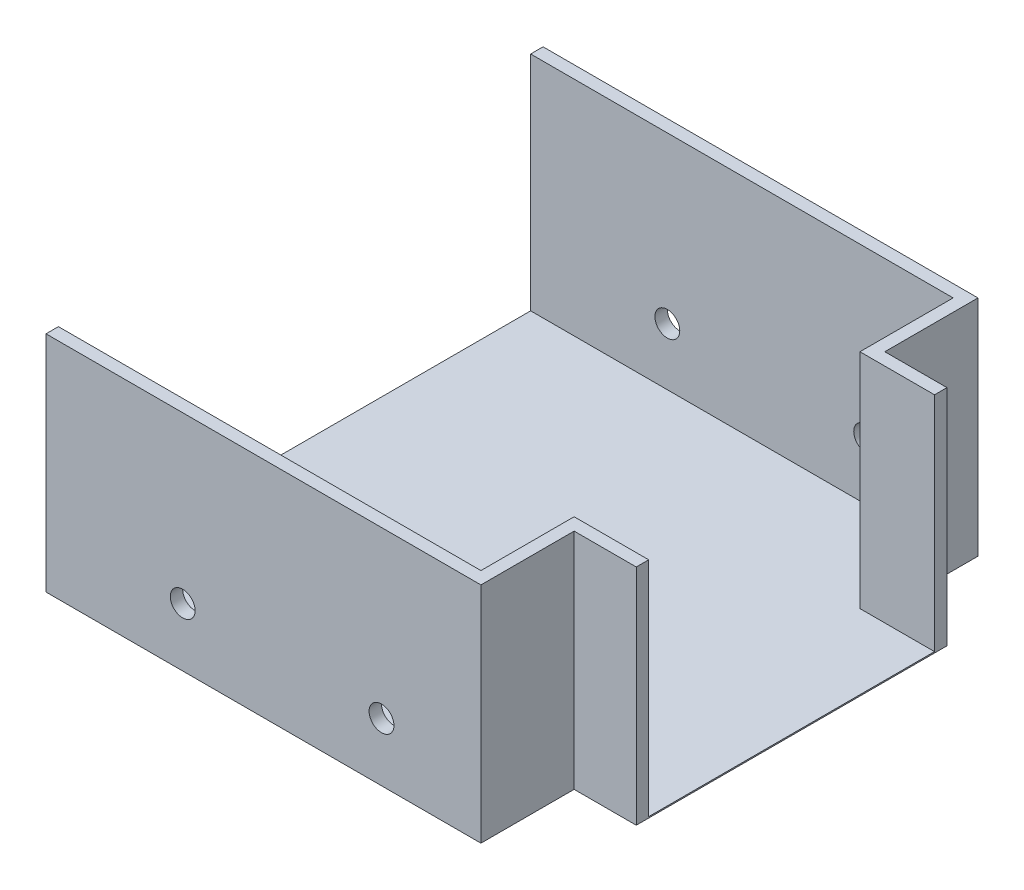
ISO-10303-21;
HEADER;
FILE_DESCRIPTION(('STEP AP214'),'2;1');
FILE_NAME('part.step','',(''),(''),'','','');
FILE_SCHEMA(('AUTOMOTIVE_DESIGN { 1 0 10303 214 1 1 1 1 }'));
ENDSEC;
DATA;
#1=APPLICATION_CONTEXT('core data for automotive mechanical design processes');
#2=APPLICATION_PROTOCOL_DEFINITION('international standard','automotive_design',2000,#1);
#3=PRODUCT_CONTEXT('',#1,'mechanical');
#4=PRODUCT('Part','Part','',(#3));
#5=PRODUCT_RELATED_PRODUCT_CATEGORY('part','',(#4));
#6=PRODUCT_DEFINITION_FORMATION('','',#4);
#7=PRODUCT_DEFINITION_CONTEXT('part definition',#1,'design');
#8=PRODUCT_DEFINITION('design','',#6,#7);
#9=PRODUCT_DEFINITION_SHAPE('','',#8);
#10=(LENGTH_UNIT() NAMED_UNIT(*) SI_UNIT(.MILLI.,.METRE.));
#11=(NAMED_UNIT(*) PLANE_ANGLE_UNIT() SI_UNIT($,.RADIAN.));
#12=(NAMED_UNIT(*) SI_UNIT($,.STERADIAN.) SOLID_ANGLE_UNIT());
#13=UNCERTAINTY_MEASURE_WITH_UNIT(LENGTH_MEASURE(1.E-05),#10,'distance_accuracy_value','');
#14=(GEOMETRIC_REPRESENTATION_CONTEXT(3) GLOBAL_UNCERTAINTY_ASSIGNED_CONTEXT((#13)) GLOBAL_UNIT_ASSIGNED_CONTEXT((#10,
#11,#12)) REPRESENTATION_CONTEXT('',''));
#15=CARTESIAN_POINT('',(0.,0.,0.));
#16=DIRECTION('',(0.,0.,1.));
#17=DIRECTION('',(1.,0.,0.));
#18=AXIS2_PLACEMENT_3D('',#15,#16,#17);
#19=CARTESIAN_POINT('',(0.,180.,0.));
#20=DIRECTION('',(0.,1.,0.));
#21=DIRECTION('',(0.,0.,1.));
#22=AXIS2_PLACEMENT_3D('',#19,#20,#21);
#23=PLANE('',#22);
#24=DIRECTION('',(1.,0.,0.));
#25=VECTOR('',#24,1.);
#26=CARTESIAN_POINT('',(0.,180.,190.));
#27=LINE('',#26,#25);
#28=CARTESIAN_POINT('',(-175.,180.,190.));
#29=VERTEX_POINT('',#28);
#30=CARTESIAN_POINT('',(165.,180.,190.));
#31=VERTEX_POINT('',#30);
#32=EDGE_CURVE('E260',#29,#31,#27,.T.);
#33=ORIENTED_EDGE('',*,*,#32,.F.);
#34=DIRECTION('',(0.,0.,1.));
#35=VECTOR('',#34,1.);
#36=CARTESIAN_POINT('',(-175.,180.,0.));
#37=LINE('',#36,#35);
#38=CARTESIAN_POINT('',(-175.,180.,200.));
#39=VERTEX_POINT('',#38);
#40=EDGE_CURVE('E294',#29,#39,#37,.T.);
#41=ORIENTED_EDGE('',*,*,#40,.T.);
#42=DIRECTION('',(1.,0.,0.));
#43=VECTOR('',#42,1.);
#44=CARTESIAN_POINT('',(0.,180.,200.));
#45=LINE('',#44,#43);
#46=CARTESIAN_POINT('',(175.,180.,200.));
#47=VERTEX_POINT('',#46);
#48=EDGE_CURVE('E299',#39,#47,#45,.T.);
#49=ORIENTED_EDGE('',*,*,#48,.T.);
#50=DIRECTION('',(0.,0.,1.));
#51=VECTOR('',#50,1.);
#52=CARTESIAN_POINT('',(175.,180.,0.));
#53=LINE('',#52,#51);
#54=CARTESIAN_POINT('',(175.,180.,125.));
#55=VERTEX_POINT('',#54);
#56=EDGE_CURVE('E145',#55,#47,#53,.T.);
#57=ORIENTED_EDGE('',*,*,#56,.F.);
#58=DIRECTION('',(1.,0.,0.));
#59=VECTOR('',#58,1.);
#60=CARTESIAN_POINT('',(0.,180.,125.));
#61=LINE('',#60,#59);
#62=CARTESIAN_POINT('',(225.,180.,125.));
#63=VERTEX_POINT('',#62);
#64=EDGE_CURVE('E139',#55,#63,#61,.T.);
#65=ORIENTED_EDGE('',*,*,#64,.T.);
#66=DIRECTION('',(0.,0.,1.));
#67=VECTOR('',#66,1.);
#68=CARTESIAN_POINT('',(225.,180.,0.));
#69=LINE('',#68,#67);
#70=CARTESIAN_POINT('',(225.,180.,115.));
#71=VERTEX_POINT('',#70);
#72=EDGE_CURVE('E124',#71,#63,#69,.T.);
#73=ORIENTED_EDGE('',*,*,#72,.F.);
#74=DIRECTION('',(1.,0.,0.));
#75=VECTOR('',#74,1.);
#76=CARTESIAN_POINT('',(0.,180.,115.));
#77=LINE('',#76,#75);
#78=CARTESIAN_POINT('',(165.,180.,115.));
#79=VERTEX_POINT('',#78);
#80=EDGE_CURVE('E229',#79,#71,#77,.T.);
#81=ORIENTED_EDGE('',*,*,#80,.F.);
#82=DIRECTION('',(0.,0.,-1.));
#83=VECTOR('',#82,1.);
#84=CARTESIAN_POINT('',(165.,180.,0.));
#85=LINE('',#84,#83);
#86=EDGE_CURVE('E264',#31,#79,#85,.T.);
#87=ORIENTED_EDGE('',*,*,#86,.F.);
#88=EDGE_LOOP('',(#33,#41,#49,#57,#65,#73,#81,#87));
#89=FACE_BOUND('',#88,.T.);
#90=ADVANCED_FACE('F43',(#89),#23,.T.);
#91=CARTESIAN_POINT('',(175.,180.,0.));
#92=DIRECTION('',(1.,0.,0.));
#93=DIRECTION('',(0.,0.,-1.));
#94=AXIS2_PLACEMENT_3D('',#91,#92,#93);
#95=PLANE('',#94);
#96=DIRECTION('',(0.,0.,1.));
#97=VECTOR('',#96,1.);
#98=CARTESIAN_POINT('',(175.,0.,0.));
#99=LINE('',#98,#97);
#100=CARTESIAN_POINT('',(175.,0.,-200.));
#101=VERTEX_POINT('',#100);
#102=CARTESIAN_POINT('',(175.,0.,-125.));
#103=VERTEX_POINT('',#102);
#104=EDGE_CURVE('E275',#101,#103,#99,.T.);
#105=ORIENTED_EDGE('',*,*,#104,.F.);
#106=DIRECTION('',(0.,-1.,0.));
#107=VECTOR('',#106,1.);
#108=CARTESIAN_POINT('',(175.,180.,-200.));
#109=LINE('',#108,#107);
#110=CARTESIAN_POINT('',(175.,180.,-200.));
#111=VERTEX_POINT('',#110);
#112=EDGE_CURVE('E11',#111,#101,#109,.T.);
#113=ORIENTED_EDGE('',*,*,#112,.F.);
#114=CARTESIAN_POINT('',(175.,180.,-125.));
#115=VERTEX_POINT('',#114);
#116=EDGE_CURVE('E286',#111,#115,#53,.T.);
#117=ORIENTED_EDGE('',*,*,#116,.T.);
#118=DIRECTION('',(0.,-1.,0.));
#119=VECTOR('',#118,1.);
#120=CARTESIAN_POINT('',(175.,180.,-125.));
#121=LINE('',#120,#119);
#122=EDGE_CURVE('E70',#115,#103,#121,.T.);
#123=ORIENTED_EDGE('',*,*,#122,.T.);
#124=EDGE_LOOP('',(#105,#113,#117,#123));
#125=FACE_BOUND('',#124,.T.);
#126=ADVANCED_FACE('F357',(#125),#95,.T.);
#127=CARTESIAN_POINT('',(0.,180.,-200.));
#128=DIRECTION('',(0.,0.,-1.));
#129=DIRECTION('',(-1.,0.,0.));
#130=AXIS2_PLACEMENT_3D('',#127,#128,#129);
#131=PLANE('',#130);
#132=CARTESIAN_POINT('',(95.,47.,-200.));
#133=DIRECTION('',(0.,0.,1.));
#134=DIRECTION('',(1.,0.,0.));
#135=AXIS2_PLACEMENT_3D('',#132,#133,#134);
#136=CIRCLE('',#135,9.99999999999999);
#137=CARTESIAN_POINT('',(105.,47.,-200.));
#138=VERTEX_POINT('',#137);
#139=EDGE_CURVE('E175',#138,#138,#136,.T.);
#140=ORIENTED_EDGE('',*,*,#139,.T.);
#141=EDGE_LOOP('',(#140));
#142=FACE_BOUND('',#141,.T.);
#143=CARTESIAN_POINT('',(-65.,47.,-200.));
#144=DIRECTION('',(0.,0.,1.));
#145=DIRECTION('',(1.,0.,0.));
#146=AXIS2_PLACEMENT_3D('',#143,#144,#145);
#147=CIRCLE('',#146,10.);
#148=CARTESIAN_POINT('',(-55.,47.,-200.));
#149=VERTEX_POINT('',#148);
#150=EDGE_CURVE('E189',#149,#149,#147,.T.);
#151=ORIENTED_EDGE('',*,*,#150,.T.);
#152=EDGE_LOOP('',(#151));
#153=FACE_BOUND('',#152,.T.);
#154=DIRECTION('',(1.,0.,0.));
#155=VECTOR('',#154,1.);
#156=CARTESIAN_POINT('',(0.,0.,-200.));
#157=LINE('',#156,#155);
#158=CARTESIAN_POINT('',(-175.,0.,-200.));
#159=VERTEX_POINT('',#158);
#160=EDGE_CURVE('E309',#159,#101,#157,.T.);
#161=ORIENTED_EDGE('',*,*,#160,.F.);
#162=DIRECTION('',(0.,-1.,0.));
#163=VECTOR('',#162,1.);
#164=CARTESIAN_POINT('',(-175.,180.,-200.));
#165=LINE('',#164,#163);
#166=CARTESIAN_POINT('',(-175.,180.,-200.));
#167=VERTEX_POINT('',#166);
#168=EDGE_CURVE('E53',#167,#159,#165,.T.);
#169=ORIENTED_EDGE('',*,*,#168,.F.);
#170=DIRECTION('',(1.,0.,0.));
#171=VECTOR('',#170,1.);
#172=CARTESIAN_POINT('',(0.,180.,-200.));
#173=LINE('',#172,#171);
#174=EDGE_CURVE('E289',#167,#111,#173,.T.);
#175=ORIENTED_EDGE('',*,*,#174,.T.);
#176=ORIENTED_EDGE('',*,*,#112,.T.);
#177=EDGE_LOOP('',(#161,#169,#175,#176));
#178=FACE_BOUND('',#177,.T.);
#179=ADVANCED_FACE('F45',(#142,#153,#178),#131,.T.);
#180=CARTESIAN_POINT('',(-175.,180.,0.));
#181=DIRECTION('',(1.,0.,0.));
#182=DIRECTION('',(0.,0.,-1.));
#183=AXIS2_PLACEMENT_3D('',#180,#181,#182);
#184=PLANE('',#183);
#185=ORIENTED_EDGE('',*,*,#40,.F.);
#186=DIRECTION('',(0.,1.,0.));
#187=VECTOR('',#186,1.);
#188=CARTESIAN_POINT('',(-175.,1.,190.));
#189=LINE('',#188,#187);
#190=CARTESIAN_POINT('',(-175.,1.,190.));
#191=VERTEX_POINT('',#190);
#192=EDGE_CURVE('E207',#191,#29,#189,.T.);
#193=ORIENTED_EDGE('',*,*,#192,.F.);
#194=DIRECTION('',(0.,0.,1.));
#195=VECTOR('',#194,1.);
#196=CARTESIAN_POINT('',(-175.,1.,190.));
#197=LINE('',#196,#195);
#198=CARTESIAN_POINT('',(-175.,1.,-190.));
#199=VERTEX_POINT('',#198);
#200=EDGE_CURVE('E211',#199,#191,#197,.T.);
#201=ORIENTED_EDGE('',*,*,#200,.F.);
#202=DIRECTION('',(0.,-1.,0.));
#203=VECTOR('',#202,1.);
#204=CARTESIAN_POINT('',(-175.,1.,-190.));
#205=LINE('',#204,#203);
#206=CARTESIAN_POINT('',(-175.,180.,-190.));
#207=VERTEX_POINT('',#206);
#208=EDGE_CURVE('E203',#207,#199,#205,.T.);
#209=ORIENTED_EDGE('',*,*,#208,.F.);
#210=EDGE_CURVE('E295',#167,#207,#37,.T.);
#211=ORIENTED_EDGE('',*,*,#210,.F.);
#212=ORIENTED_EDGE('',*,*,#168,.T.);
#213=DIRECTION('',(0.,0.,1.));
#214=VECTOR('',#213,1.);
#215=CARTESIAN_POINT('',(-175.,0.,0.));
#216=LINE('',#215,#214);
#217=CARTESIAN_POINT('',(-175.,0.,200.));
#218=VERTEX_POINT('',#217);
#219=EDGE_CURVE('E314',#159,#218,#216,.T.);
#220=ORIENTED_EDGE('',*,*,#219,.T.);
#221=DIRECTION('',(0.,-1.,0.));
#222=VECTOR('',#221,1.);
#223=CARTESIAN_POINT('',(-175.,180.,200.));
#224=LINE('',#223,#222);
#225=EDGE_CURVE('E166',#39,#218,#224,.T.);
#226=ORIENTED_EDGE('',*,*,#225,.F.);
#227=EDGE_LOOP('',(#185,#193,#201,#209,#211,#212,#220,#226));
#228=FACE_BOUND('',#227,.T.);
#229=ADVANCED_FACE('F390',(#228),#184,.F.);
#230=CARTESIAN_POINT('',(0.,180.,200.));
#231=DIRECTION('',(0.,0.,-1.));
#232=DIRECTION('',(-1.,0.,0.));
#233=AXIS2_PLACEMENT_3D('',#230,#231,#232);
#234=PLANE('',#233);
#235=CARTESIAN_POINT('',(95.,47.,200.));
#236=DIRECTION('',(0.,0.,1.));
#237=DIRECTION('',(1.,0.,0.));
#238=AXIS2_PLACEMENT_3D('',#235,#236,#237);
#239=CIRCLE('',#238,9.99999999999999);
#240=CARTESIAN_POINT('',(105.,47.,200.));
#241=VERTEX_POINT('',#240);
#242=EDGE_CURVE('E183',#241,#241,#239,.T.);
#243=ORIENTED_EDGE('',*,*,#242,.F.);
#244=EDGE_LOOP('',(#243));
#245=FACE_BOUND('',#244,.T.);
#246=CARTESIAN_POINT('',(-65.,47.,200.));
#247=DIRECTION('',(0.,0.,1.));
#248=DIRECTION('',(1.,0.,0.));
#249=AXIS2_PLACEMENT_3D('',#246,#247,#248);
#250=CIRCLE('',#249,10.);
#251=CARTESIAN_POINT('',(-55.,47.,200.));
#252=VERTEX_POINT('',#251);
#253=EDGE_CURVE('E195',#252,#252,#250,.T.);
#254=ORIENTED_EDGE('',*,*,#253,.F.);
#255=EDGE_LOOP('',(#254));
#256=FACE_BOUND('',#255,.T.);
#257=DIRECTION('',(1.,0.,0.));
#258=VECTOR('',#257,1.);
#259=CARTESIAN_POINT('',(0.,0.,200.));
#260=LINE('',#259,#258);
#261=CARTESIAN_POINT('',(175.,0.,200.));
#262=VERTEX_POINT('',#261);
#263=EDGE_CURVE('E317',#218,#262,#260,.T.);
#264=ORIENTED_EDGE('',*,*,#263,.T.);
#265=DIRECTION('',(0.,-1.,0.));
#266=VECTOR('',#265,1.);
#267=CARTESIAN_POINT('',(175.,180.,200.));
#268=LINE('',#267,#266);
#269=EDGE_CURVE('E159',#47,#262,#268,.T.);
#270=ORIENTED_EDGE('',*,*,#269,.F.);
#271=ORIENTED_EDGE('',*,*,#48,.F.);
#272=ORIENTED_EDGE('',*,*,#225,.T.);
#273=EDGE_LOOP('',(#264,#270,#271,#272));
#274=FACE_BOUND('',#273,.T.);
#275=ADVANCED_FACE('F436',(#245,#256,#274),#234,.F.);
#276=CARTESIAN_POINT('',(175.,0.,125.));
#277=VERTEX_POINT('',#276);
#278=EDGE_CURVE('E310',#277,#262,#99,.T.);
#279=ORIENTED_EDGE('',*,*,#278,.F.);
#280=DIRECTION('',(0.,-1.,0.));
#281=VECTOR('',#280,1.);
#282=CARTESIAN_POINT('',(175.,180.,125.));
#283=LINE('',#282,#281);
#284=EDGE_CURVE('E154',#55,#277,#283,.T.);
#285=ORIENTED_EDGE('',*,*,#284,.F.);
#286=ORIENTED_EDGE('',*,*,#56,.T.);
#287=ORIENTED_EDGE('',*,*,#269,.T.);
#288=EDGE_LOOP('',(#279,#285,#286,#287));
#289=FACE_BOUND('',#288,.T.);
#290=ADVANCED_FACE('F364',(#289),#95,.T.);
#291=CARTESIAN_POINT('',(0.,180.,125.));
#292=DIRECTION('',(0.,0.,-1.));
#293=DIRECTION('',(-1.,0.,0.));
#294=AXIS2_PLACEMENT_3D('',#291,#292,#293);
#295=PLANE('',#294);
#296=DIRECTION('',(1.,0.,0.));
#297=VECTOR('',#296,1.);
#298=CARTESIAN_POINT('',(0.,0.,125.));
#299=LINE('',#298,#297);
#300=CARTESIAN_POINT('',(225.,0.,125.));
#301=VERTEX_POINT('',#300);
#302=EDGE_CURVE('E151',#277,#301,#299,.T.);
#303=ORIENTED_EDGE('',*,*,#302,.T.);
#304=DIRECTION('',(0.,-1.,0.));
#305=VECTOR('',#304,1.);
#306=CARTESIAN_POINT('',(225.,180.,125.));
#307=LINE('',#306,#305);
#308=EDGE_CURVE('E129',#63,#301,#307,.T.);
#309=ORIENTED_EDGE('',*,*,#308,.F.);
#310=ORIENTED_EDGE('',*,*,#64,.F.);
#311=ORIENTED_EDGE('',*,*,#284,.T.);
#312=EDGE_LOOP('',(#303,#309,#310,#311));
#313=FACE_BOUND('',#312,.T.);
#314=ADVANCED_FACE('F149',(#313),#295,.F.);
#315=CARTESIAN_POINT('',(225.,180.,0.));
#316=DIRECTION('',(1.,0.,0.));
#317=DIRECTION('',(0.,0.,-1.));
#318=AXIS2_PLACEMENT_3D('',#315,#316,#317);
#319=PLANE('',#318);
#320=DIRECTION('',(0.,1.,0.));
#321=VECTOR('',#320,1.);
#322=CARTESIAN_POINT('',(225.,1.,115.));
#323=LINE('',#322,#321);
#324=CARTESIAN_POINT('',(225.,1.,115.));
#325=VERTEX_POINT('',#324);
#326=EDGE_CURVE('E134',#325,#71,#323,.T.);
#327=ORIENTED_EDGE('',*,*,#326,.T.);
#328=ORIENTED_EDGE('',*,*,#72,.T.);
#329=ORIENTED_EDGE('',*,*,#308,.T.);
#330=DIRECTION('',(0.,0.,1.));
#331=VECTOR('',#330,1.);
#332=CARTESIAN_POINT('',(225.,0.,0.));
#333=LINE('',#332,#331);
#334=CARTESIAN_POINT('',(225.,0.,-125.));
#335=VERTEX_POINT('',#334);
#336=EDGE_CURVE('E323',#335,#301,#333,.T.);
#337=ORIENTED_EDGE('',*,*,#336,.F.);
#338=DIRECTION('',(0.,-1.,0.));
#339=VECTOR('',#338,1.);
#340=CARTESIAN_POINT('',(225.,180.,-125.));
#341=LINE('',#340,#339);
#342=CARTESIAN_POINT('',(225.,180.,-125.));
#343=VERTEX_POINT('',#342);
#344=EDGE_CURVE('E155',#343,#335,#341,.T.);
#345=ORIENTED_EDGE('',*,*,#344,.F.);
#346=CARTESIAN_POINT('',(225.,180.,-115.));
#347=VERTEX_POINT('',#346);
#348=EDGE_CURVE('E138',#343,#347,#69,.T.);
#349=ORIENTED_EDGE('',*,*,#348,.T.);
#350=DIRECTION('',(0.,-1.,0.));
#351=VECTOR('',#350,1.);
#352=CARTESIAN_POINT('',(225.,1.,-115.));
#353=LINE('',#352,#351);
#354=CARTESIAN_POINT('',(225.,1.,-115.));
#355=VERTEX_POINT('',#354);
#356=EDGE_CURVE('E218',#347,#355,#353,.T.);
#357=ORIENTED_EDGE('',*,*,#356,.T.);
#358=DIRECTION('',(0.,0.,1.));
#359=VECTOR('',#358,1.);
#360=CARTESIAN_POINT('',(225.,1.,-115.));
#361=LINE('',#360,#359);
#362=EDGE_CURVE('E215',#355,#325,#361,.T.);
#363=ORIENTED_EDGE('',*,*,#362,.T.);
#364=EDGE_LOOP('',(#327,#328,#329,#337,#345,#349,#357,#363));
#365=FACE_BOUND('',#364,.T.);
#366=ADVANCED_FACE('F126',(#365),#319,.T.);
#367=CARTESIAN_POINT('',(0.,180.,-125.));
#368=DIRECTION('',(0.,0.,-1.));
#369=DIRECTION('',(-1.,0.,0.));
#370=AXIS2_PLACEMENT_3D('',#367,#368,#369);
#371=PLANE('',#370);
#372=DIRECTION('',(1.,0.,0.));
#373=VECTOR('',#372,1.);
#374=CARTESIAN_POINT('',(0.,0.,-125.));
#375=LINE('',#374,#373);
#376=EDGE_CURVE('E290',#103,#335,#375,.T.);
#377=ORIENTED_EDGE('',*,*,#376,.F.);
#378=ORIENTED_EDGE('',*,*,#122,.F.);
#379=DIRECTION('',(1.,0.,0.));
#380=VECTOR('',#379,1.);
#381=CARTESIAN_POINT('',(0.,180.,-125.));
#382=LINE('',#381,#380);
#383=EDGE_CURVE('E304',#115,#343,#382,.T.);
#384=ORIENTED_EDGE('',*,*,#383,.T.);
#385=ORIENTED_EDGE('',*,*,#344,.T.);
#386=EDGE_LOOP('',(#377,#378,#384,#385));
#387=FACE_BOUND('',#386,.T.);
#388=ADVANCED_FACE('F369',(#387),#371,.T.);
#389=ORIENTED_EDGE('',*,*,#210,.T.);
#390=DIRECTION('',(-1.,0.,0.));
#391=VECTOR('',#390,1.);
#392=CARTESIAN_POINT('',(0.,180.,-190.));
#393=LINE('',#392,#391);
#394=CARTESIAN_POINT('',(165.,180.,-190.));
#395=VERTEX_POINT('',#394);
#396=EDGE_CURVE('E256',#395,#207,#393,.T.);
#397=ORIENTED_EDGE('',*,*,#396,.F.);
#398=DIRECTION('',(0.,0.,-1.));
#399=VECTOR('',#398,1.);
#400=CARTESIAN_POINT('',(165.,180.,-1.22124532708767E-13));
#401=LINE('',#400,#399);
#402=CARTESIAN_POINT('',(165.,180.,-115.));
#403=VERTEX_POINT('',#402);
#404=EDGE_CURVE('E252',#403,#395,#401,.T.);
#405=ORIENTED_EDGE('',*,*,#404,.F.);
#406=DIRECTION('',(-1.,0.,0.));
#407=VECTOR('',#406,1.);
#408=CARTESIAN_POINT('',(0.,180.,-115.));
#409=LINE('',#408,#407);
#410=EDGE_CURVE('E61',#347,#403,#409,.T.);
#411=ORIENTED_EDGE('',*,*,#410,.F.);
#412=ORIENTED_EDGE('',*,*,#348,.F.);
#413=ORIENTED_EDGE('',*,*,#383,.F.);
#414=ORIENTED_EDGE('',*,*,#116,.F.);
#415=ORIENTED_EDGE('',*,*,#174,.F.);
#416=EDGE_LOOP('',(#389,#397,#405,#411,#412,#413,#414,#415));
#417=FACE_BOUND('',#416,.T.);
#418=ADVANCED_FACE('F359',(#417),#23,.T.);
#419=CARTESIAN_POINT('',(0.,0.,0.));
#420=DIRECTION('',(0.,1.,0.));
#421=DIRECTION('',(0.,0.,1.));
#422=AXIS2_PLACEMENT_3D('',#419,#420,#421);
#423=PLANE('',#422);
#424=ORIENTED_EDGE('',*,*,#104,.T.);
#425=ORIENTED_EDGE('',*,*,#376,.T.);
#426=ORIENTED_EDGE('',*,*,#336,.T.);
#427=ORIENTED_EDGE('',*,*,#302,.F.);
#428=ORIENTED_EDGE('',*,*,#278,.T.);
#429=ORIENTED_EDGE('',*,*,#263,.F.);
#430=ORIENTED_EDGE('',*,*,#219,.F.);
#431=ORIENTED_EDGE('',*,*,#160,.T.);
#432=EDGE_LOOP('',(#424,#425,#426,#427,#428,#429,#430,#431));
#433=FACE_BOUND('',#432,.T.);
#434=ADVANCED_FACE('F368',(#433),#423,.F.);
#435=CARTESIAN_POINT('',(0.,1.,-115.));
#436=DIRECTION('',(0.,0.,-1.));
#437=DIRECTION('',(-1.,0.,0.));
#438=AXIS2_PLACEMENT_3D('',#435,#436,#437);
#439=PLANE('',#438);
#440=ORIENTED_EDGE('',*,*,#410,.T.);
#441=DIRECTION('',(0.,1.,0.));
#442=VECTOR('',#441,1.);
#443=CARTESIAN_POINT('',(165.,1.,-115.));
#444=LINE('',#443,#442);
#445=CARTESIAN_POINT('',(165.,1.,-115.));
#446=VERTEX_POINT('',#445);
#447=EDGE_CURVE('E249',#446,#403,#444,.T.);
#448=ORIENTED_EDGE('',*,*,#447,.F.);
#449=DIRECTION('',(-1.,0.,0.));
#450=VECTOR('',#449,1.);
#451=CARTESIAN_POINT('',(0.,1.,-115.));
#452=LINE('',#451,#450);
#453=EDGE_CURVE('E224',#355,#446,#452,.T.);
#454=ORIENTED_EDGE('',*,*,#453,.F.);
#455=ORIENTED_EDGE('',*,*,#356,.F.);
#456=EDGE_LOOP('',(#440,#448,#454,#455));
#457=FACE_BOUND('',#456,.T.);
#458=ADVANCED_FACE('F375',(#457),#439,.F.);
#459=CARTESIAN_POINT('',(0.,1.,115.));
#460=DIRECTION('',(0.,0.,1.));
#461=DIRECTION('',(1.,0.,0.));
#462=AXIS2_PLACEMENT_3D('',#459,#460,#461);
#463=PLANE('',#462);
#464=ORIENTED_EDGE('',*,*,#80,.T.);
#465=ORIENTED_EDGE('',*,*,#326,.F.);
#466=DIRECTION('',(1.,0.,0.));
#467=VECTOR('',#466,1.);
#468=CARTESIAN_POINT('',(0.,1.,115.));
#469=LINE('',#468,#467);
#470=CARTESIAN_POINT('',(165.,1.,115.));
#471=VERTEX_POINT('',#470);
#472=EDGE_CURVE('E245',#471,#325,#469,.T.);
#473=ORIENTED_EDGE('',*,*,#472,.F.);
#474=DIRECTION('',(0.,1.,0.));
#475=VECTOR('',#474,1.);
#476=CARTESIAN_POINT('',(165.,1.,115.));
#477=LINE('',#476,#475);
#478=EDGE_CURVE('E271',#471,#79,#477,.T.);
#479=ORIENTED_EDGE('',*,*,#478,.T.);
#480=EDGE_LOOP('',(#464,#465,#473,#479));
#481=FACE_BOUND('',#480,.T.);
#482=ADVANCED_FACE('F426',(#481),#463,.F.);
#483=CARTESIAN_POINT('',(165.,1.,0.));
#484=DIRECTION('',(1.,0.,0.));
#485=DIRECTION('',(0.,0.,-1.));
#486=AXIS2_PLACEMENT_3D('',#483,#484,#485);
#487=PLANE('',#486);
#488=ORIENTED_EDGE('',*,*,#86,.T.);
#489=ORIENTED_EDGE('',*,*,#478,.F.);
#490=DIRECTION('',(0.,0.,-1.));
#491=VECTOR('',#490,1.);
#492=CARTESIAN_POINT('',(165.,1.,0.));
#493=LINE('',#492,#491);
#494=CARTESIAN_POINT('',(165.,1.,190.));
#495=VERTEX_POINT('',#494);
#496=EDGE_CURVE('E241',#495,#471,#493,.T.);
#497=ORIENTED_EDGE('',*,*,#496,.F.);
#498=DIRECTION('',(0.,1.,0.));
#499=VECTOR('',#498,1.);
#500=CARTESIAN_POINT('',(165.,1.,190.));
#501=LINE('',#500,#499);
#502=EDGE_CURVE('E276',#495,#31,#501,.T.);
#503=ORIENTED_EDGE('',*,*,#502,.T.);
#504=EDGE_LOOP('',(#488,#489,#497,#503));
#505=FACE_BOUND('',#504,.T.);
#506=ADVANCED_FACE('F428',(#505),#487,.F.);
#507=CARTESIAN_POINT('',(0.,1.,190.));
#508=DIRECTION('',(0.,0.,1.));
#509=DIRECTION('',(1.,0.,0.));
#510=AXIS2_PLACEMENT_3D('',#507,#508,#509);
#511=PLANE('',#510);
#512=CARTESIAN_POINT('',(95.,47.,190.));
#513=DIRECTION('',(0.,0.,1.));
#514=DIRECTION('',(1.,0.,0.));
#515=AXIS2_PLACEMENT_3D('',#512,#513,#514);
#516=CIRCLE('',#515,9.99999999999999);
#517=CARTESIAN_POINT('',(105.,47.,190.));
#518=VERTEX_POINT('',#517);
#519=EDGE_CURVE('E199',#518,#518,#516,.T.);
#520=ORIENTED_EDGE('',*,*,#519,.T.);
#521=EDGE_LOOP('',(#520));
#522=FACE_BOUND('',#521,.T.);
#523=CARTESIAN_POINT('',(-65.,47.,190.));
#524=DIRECTION('',(0.,0.,1.));
#525=DIRECTION('',(1.,0.,0.));
#526=AXIS2_PLACEMENT_3D('',#523,#524,#525);
#527=CIRCLE('',#526,10.);
#528=CARTESIAN_POINT('',(-55.,47.,190.));
#529=VERTEX_POINT('',#528);
#530=EDGE_CURVE('E174',#529,#529,#527,.T.);
#531=ORIENTED_EDGE('',*,*,#530,.T.);
#532=EDGE_LOOP('',(#531));
#533=FACE_BOUND('',#532,.T.);
#534=ORIENTED_EDGE('',*,*,#32,.T.);
#535=ORIENTED_EDGE('',*,*,#502,.F.);
#536=DIRECTION('',(1.,0.,0.));
#537=VECTOR('',#536,1.);
#538=CARTESIAN_POINT('',(0.,1.,190.));
#539=LINE('',#538,#537);
#540=EDGE_CURVE('E237',#191,#495,#539,.T.);
#541=ORIENTED_EDGE('',*,*,#540,.F.);
#542=ORIENTED_EDGE('',*,*,#192,.T.);
#543=EDGE_LOOP('',(#534,#535,#541,#542));
#544=FACE_BOUND('',#543,.T.);
#545=ADVANCED_FACE('F431',(#522,#533,#544),#511,.F.);
#546=CARTESIAN_POINT('',(0.,1.,-190.));
#547=DIRECTION('',(0.,0.,-1.));
#548=DIRECTION('',(-1.,0.,0.));
#549=AXIS2_PLACEMENT_3D('',#546,#547,#548);
#550=PLANE('',#549);
#551=CARTESIAN_POINT('',(95.,47.,-190.));
#552=DIRECTION('',(0.,0.,-1.));
#553=DIRECTION('',(-1.,0.,0.));
#554=AXIS2_PLACEMENT_3D('',#551,#552,#553);
#555=CIRCLE('',#554,9.99999999999999);
#556=CARTESIAN_POINT('',(85.,47.,-190.));
#557=VERTEX_POINT('',#556);
#558=EDGE_CURVE('E47',#557,#557,#555,.T.);
#559=ORIENTED_EDGE('',*,*,#558,.T.);
#560=EDGE_LOOP('',(#559));
#561=FACE_BOUND('',#560,.T.);
#562=CARTESIAN_POINT('',(-65.,47.,-190.));
#563=DIRECTION('',(0.,0.,-1.));
#564=DIRECTION('',(-1.,0.,0.));
#565=AXIS2_PLACEMENT_3D('',#562,#563,#564);
#566=CIRCLE('',#565,10.);
#567=CARTESIAN_POINT('',(-75.,47.,-190.));
#568=VERTEX_POINT('',#567);
#569=EDGE_CURVE('E171',#568,#568,#566,.T.);
#570=ORIENTED_EDGE('',*,*,#569,.T.);
#571=EDGE_LOOP('',(#570));
#572=FACE_BOUND('',#571,.T.);
#573=ORIENTED_EDGE('',*,*,#396,.T.);
#574=ORIENTED_EDGE('',*,*,#208,.T.);
#575=DIRECTION('',(-1.,0.,0.));
#576=VECTOR('',#575,1.);
#577=CARTESIAN_POINT('',(0.,1.,-190.));
#578=LINE('',#577,#576);
#579=CARTESIAN_POINT('',(165.,1.,-190.));
#580=VERTEX_POINT('',#579);
#581=EDGE_CURVE('E233',#580,#199,#578,.T.);
#582=ORIENTED_EDGE('',*,*,#581,.F.);
#583=DIRECTION('',(0.,1.,0.));
#584=VECTOR('',#583,1.);
#585=CARTESIAN_POINT('',(165.,1.,-190.));
#586=LINE('',#585,#584);
#587=EDGE_CURVE('E280',#580,#395,#586,.T.);
#588=ORIENTED_EDGE('',*,*,#587,.T.);
#589=EDGE_LOOP('',(#573,#574,#582,#588));
#590=FACE_BOUND('',#589,.T.);
#591=ADVANCED_FACE('F337',(#561,#572,#590),#550,.F.);
#592=CARTESIAN_POINT('',(165.,1.,-1.22124532708767E-13));
#593=DIRECTION('',(1.,0.,0.));
#594=DIRECTION('',(0.,0.,-1.));
#595=AXIS2_PLACEMENT_3D('',#592,#593,#594);
#596=PLANE('',#595);
#597=ORIENTED_EDGE('',*,*,#404,.T.);
#598=ORIENTED_EDGE('',*,*,#587,.F.);
#599=DIRECTION('',(0.,0.,-1.));
#600=VECTOR('',#599,1.);
#601=CARTESIAN_POINT('',(165.,1.,-1.22124532708767E-13));
#602=LINE('',#601,#600);
#603=EDGE_CURVE('E228',#446,#580,#602,.T.);
#604=ORIENTED_EDGE('',*,*,#603,.F.);
#605=ORIENTED_EDGE('',*,*,#447,.T.);
#606=EDGE_LOOP('',(#597,#598,#604,#605));
#607=FACE_BOUND('',#606,.T.);
#608=ADVANCED_FACE('F444',(#607),#596,.F.);
#609=CARTESIAN_POINT('',(0.,1.,0.));
#610=DIRECTION('',(0.,1.,0.));
#611=DIRECTION('',(0.,0.,1.));
#612=AXIS2_PLACEMENT_3D('',#609,#610,#611);
#613=PLANE('',#612);
#614=ORIENTED_EDGE('',*,*,#453,.T.);
#615=ORIENTED_EDGE('',*,*,#603,.T.);
#616=ORIENTED_EDGE('',*,*,#581,.T.);
#617=ORIENTED_EDGE('',*,*,#200,.T.);
#618=ORIENTED_EDGE('',*,*,#540,.T.);
#619=ORIENTED_EDGE('',*,*,#496,.T.);
#620=ORIENTED_EDGE('',*,*,#472,.T.);
#621=ORIENTED_EDGE('',*,*,#362,.F.);
#622=EDGE_LOOP('',(#614,#615,#616,#617,#618,#619,#620,#621));
#623=FACE_BOUND('',#622,.T.);
#624=ADVANCED_FACE('F352',(#623),#613,.T.);
#625=CARTESIAN_POINT('',(-65.,47.,-200.));
#626=DIRECTION('',(0.,0.,1.));
#627=DIRECTION('',(1.,0.,0.));
#628=AXIS2_PLACEMENT_3D('',#625,#626,#627);
#629=CYLINDRICAL_SURFACE('',#628,10.);
#630=ORIENTED_EDGE('',*,*,#150,.F.);
#631=EDGE_LOOP('',(#630));
#632=FACE_BOUND('',#631,.T.);
#633=ORIENTED_EDGE('',*,*,#569,.F.);
#634=EDGE_LOOP('',(#633));
#635=FACE_BOUND('',#634,.T.);
#636=ADVANCED_FACE('F342',(#632,#635),#629,.F.);
#637=CARTESIAN_POINT('',(95.,47.,-200.));
#638=DIRECTION('',(0.,0.,1.));
#639=DIRECTION('',(1.,0.,0.));
#640=AXIS2_PLACEMENT_3D('',#637,#638,#639);
#641=CYLINDRICAL_SURFACE('',#640,9.99999999999999);
#642=ORIENTED_EDGE('',*,*,#139,.F.);
#643=EDGE_LOOP('',(#642));
#644=FACE_BOUND('',#643,.T.);
#645=ORIENTED_EDGE('',*,*,#558,.F.);
#646=EDGE_LOOP('',(#645));
#647=FACE_BOUND('',#646,.T.);
#648=ADVANCED_FACE('F339',(#644,#647),#641,.F.);
#649=ORIENTED_EDGE('',*,*,#253,.T.);
#650=EDGE_LOOP('',(#649));
#651=FACE_BOUND('',#650,.T.);
#652=ORIENTED_EDGE('',*,*,#530,.F.);
#653=EDGE_LOOP('',(#652));
#654=FACE_BOUND('',#653,.T.);
#655=ADVANCED_FACE('F341',(#651,#654),#629,.F.);
#656=ORIENTED_EDGE('',*,*,#242,.T.);
#657=EDGE_LOOP('',(#656));
#658=FACE_BOUND('',#657,.T.);
#659=ORIENTED_EDGE('',*,*,#519,.F.);
#660=EDGE_LOOP('',(#659));
#661=FACE_BOUND('',#660,.T.);
#662=ADVANCED_FACE('F345',(#658,#661),#641,.F.);
#663=CLOSED_SHELL('',(#90,#126,#179,#229,#275,#290,#314,#366,#388,#418,#434,#458,#482,#506,#545,
#591,#608,#624,#636,#648,#655,#662));
#664=MANIFOLD_SOLID_BREP('B2',#663);
#665=ADVANCED_BREP_SHAPE_REPRESENTATION('',(#18,#664),#14);
#666=SHAPE_DEFINITION_REPRESENTATION(#9,#665);
ENDSEC;
END-ISO-10303-21;
